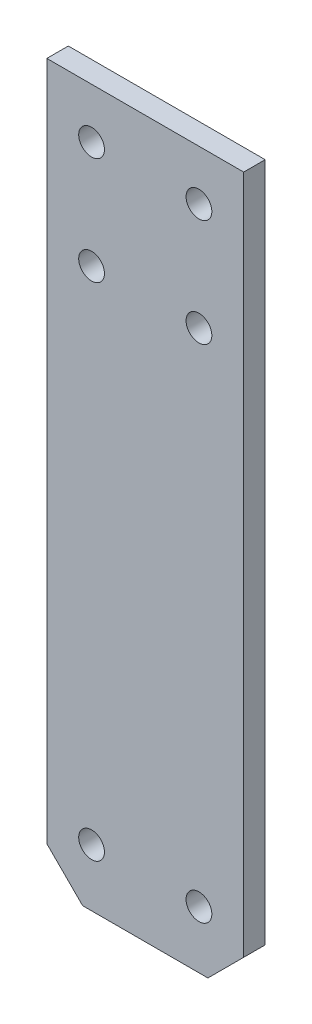
ISO-10303-21;
HEADER;
FILE_DESCRIPTION(('STEP AP214'),'2;1');
FILE_NAME('part.step','',(''),(''),'','','');
FILE_SCHEMA(('AUTOMOTIVE_DESIGN { 1 0 10303 214 1 1 1 1 }'));
ENDSEC;
DATA;
#1=APPLICATION_CONTEXT('core data for automotive mechanical design processes');
#2=APPLICATION_PROTOCOL_DEFINITION('international standard','automotive_design',2000,#1);
#3=PRODUCT_CONTEXT('',#1,'mechanical');
#4=PRODUCT('Part','Part','',(#3));
#5=PRODUCT_RELATED_PRODUCT_CATEGORY('part','',(#4));
#6=PRODUCT_DEFINITION_FORMATION('','',#4);
#7=PRODUCT_DEFINITION_CONTEXT('part definition',#1,'design');
#8=PRODUCT_DEFINITION('design','',#6,#7);
#9=PRODUCT_DEFINITION_SHAPE('','',#8);
#10=(LENGTH_UNIT() NAMED_UNIT(*) SI_UNIT(.MILLI.,.METRE.));
#11=(NAMED_UNIT(*) PLANE_ANGLE_UNIT() SI_UNIT($,.RADIAN.));
#12=(NAMED_UNIT(*) SI_UNIT($,.STERADIAN.) SOLID_ANGLE_UNIT());
#13=UNCERTAINTY_MEASURE_WITH_UNIT(LENGTH_MEASURE(1.E-05),#10,'distance_accuracy_value','');
#14=(GEOMETRIC_REPRESENTATION_CONTEXT(3) GLOBAL_UNCERTAINTY_ASSIGNED_CONTEXT((#13)) GLOBAL_UNIT_ASSIGNED_CONTEXT((#10,
#11,#12)) REPRESENTATION_CONTEXT('',''));
#15=CARTESIAN_POINT('',(0.,0.,0.));
#16=DIRECTION('',(0.,0.,1.));
#17=DIRECTION('',(1.,0.,0.));
#18=AXIS2_PLACEMENT_3D('',#15,#16,#17);
#19=CARTESIAN_POINT('',(13.75,-50.,3.));
#20=DIRECTION('',(-1.,0.,0.));
#21=DIRECTION('',(0.,0.,1.));
#22=AXIS2_PLACEMENT_3D('',#19,#20,#21);
#23=PLANE('',#22);
#24=DIRECTION('',(0.,1.,0.));
#25=VECTOR('',#24,1.);
#26=CARTESIAN_POINT('',(13.75,-50.,3.));
#27=LINE('',#26,#25);
#28=CARTESIAN_POINT('',(13.75,-45.,3.));
#29=VERTEX_POINT('',#28);
#30=CARTESIAN_POINT('',(13.75,50.,3.));
#31=VERTEX_POINT('',#30);
#32=EDGE_CURVE('E86',#29,#31,#27,.T.);
#33=ORIENTED_EDGE('',*,*,#32,.F.);
#34=DIRECTION('',(0.,0.,-1.));
#35=VECTOR('',#34,1.);
#36=CARTESIAN_POINT('',(13.75,-45.,3.));
#37=LINE('',#36,#35);
#38=CARTESIAN_POINT('',(13.75,-45.,0.));
#39=VERTEX_POINT('',#38);
#40=EDGE_CURVE('E109',#29,#39,#37,.T.);
#41=ORIENTED_EDGE('',*,*,#40,.T.);
#42=DIRECTION('',(0.,1.,0.));
#43=VECTOR('',#42,1.);
#44=CARTESIAN_POINT('',(13.75,-50.,0.));
#45=LINE('',#44,#43);
#46=CARTESIAN_POINT('',(13.75,50.,0.));
#47=VERTEX_POINT('',#46);
#48=EDGE_CURVE('E107',#39,#47,#45,.T.);
#49=ORIENTED_EDGE('',*,*,#48,.T.);
#50=DIRECTION('',(0.,0.,-1.));
#51=VECTOR('',#50,1.);
#52=CARTESIAN_POINT('',(13.75,50.,3.));
#53=LINE('',#52,#51);
#54=EDGE_CURVE('E101',#31,#47,#53,.T.);
#55=ORIENTED_EDGE('',*,*,#54,.F.);
#56=EDGE_LOOP('',(#33,#41,#49,#55));
#57=FACE_BOUND('',#56,.T.);
#58=ADVANCED_FACE('F32',(#57),#23,.F.);
#59=CARTESIAN_POINT('',(-13.75,50.,3.));
#60=DIRECTION('',(0.,-1.,0.));
#61=DIRECTION('',(0.,0.,-1.));
#62=AXIS2_PLACEMENT_3D('',#59,#60,#61);
#63=PLANE('',#62);
#64=DIRECTION('',(-1.,0.,0.));
#65=VECTOR('',#64,1.);
#66=CARTESIAN_POINT('',(-13.75,50.,0.));
#67=LINE('',#66,#65);
#68=CARTESIAN_POINT('',(-13.75,50.,0.));
#69=VERTEX_POINT('',#68);
#70=EDGE_CURVE('E160',#47,#69,#67,.T.);
#71=ORIENTED_EDGE('',*,*,#70,.T.);
#72=DIRECTION('',(0.,0.,-1.));
#73=VECTOR('',#72,1.);
#74=CARTESIAN_POINT('',(-13.75,50.,3.));
#75=LINE('',#74,#73);
#76=CARTESIAN_POINT('',(-13.75,50.,3.));
#77=VERTEX_POINT('',#76);
#78=EDGE_CURVE('E103',#77,#69,#75,.T.);
#79=ORIENTED_EDGE('',*,*,#78,.F.);
#80=DIRECTION('',(-1.,0.,0.));
#81=VECTOR('',#80,1.);
#82=CARTESIAN_POINT('',(-13.75,50.,3.));
#83=LINE('',#82,#81);
#84=EDGE_CURVE('E89',#31,#77,#83,.T.);
#85=ORIENTED_EDGE('',*,*,#84,.F.);
#86=ORIENTED_EDGE('',*,*,#54,.T.);
#87=EDGE_LOOP('',(#71,#79,#85,#86));
#88=FACE_BOUND('',#87,.T.);
#89=ADVANCED_FACE('F100',(#88),#63,.F.);
#90=CARTESIAN_POINT('',(-13.75,-50.,3.));
#91=DIRECTION('',(1.,0.,0.));
#92=DIRECTION('',(0.,0.,-1.));
#93=AXIS2_PLACEMENT_3D('',#90,#91,#92);
#94=PLANE('',#93);
#95=DIRECTION('',(0.,-1.,0.));
#96=VECTOR('',#95,1.);
#97=CARTESIAN_POINT('',(-13.75,-50.,0.));
#98=LINE('',#97,#96);
#99=CARTESIAN_POINT('',(-13.75,-45.,0.));
#100=VERTEX_POINT('',#99);
#101=EDGE_CURVE('E158',#69,#100,#98,.T.);
#102=ORIENTED_EDGE('',*,*,#101,.T.);
#103=DIRECTION('',(0.,0.,1.));
#104=VECTOR('',#103,1.);
#105=CARTESIAN_POINT('',(-13.75,-45.,3.));
#106=LINE('',#105,#104);
#107=CARTESIAN_POINT('',(-13.75,-45.,3.));
#108=VERTEX_POINT('',#107);
#109=EDGE_CURVE('E11',#100,#108,#106,.T.);
#110=ORIENTED_EDGE('',*,*,#109,.T.);
#111=DIRECTION('',(0.,-1.,0.));
#112=VECTOR('',#111,1.);
#113=CARTESIAN_POINT('',(-13.75,-50.,3.));
#114=LINE('',#113,#112);
#115=EDGE_CURVE('E104',#77,#108,#114,.T.);
#116=ORIENTED_EDGE('',*,*,#115,.F.);
#117=ORIENTED_EDGE('',*,*,#78,.T.);
#118=EDGE_LOOP('',(#102,#110,#116,#117));
#119=FACE_BOUND('',#118,.T.);
#120=ADVANCED_FACE('F159',(#119),#94,.F.);
#121=CARTESIAN_POINT('',(-13.75,-50.,3.));
#122=DIRECTION('',(0.,1.,0.));
#123=DIRECTION('',(0.,0.,1.));
#124=AXIS2_PLACEMENT_3D('',#121,#122,#123);
#125=PLANE('',#124);
#126=DIRECTION('',(1.,0.,0.));
#127=VECTOR('',#126,1.);
#128=CARTESIAN_POINT('',(-13.75,-50.,0.));
#129=LINE('',#128,#127);
#130=CARTESIAN_POINT('',(-8.75000000000002,-50.,0.));
#131=VERTEX_POINT('',#130);
#132=CARTESIAN_POINT('',(8.75000000000002,-50.,0.));
#133=VERTEX_POINT('',#132);
#134=EDGE_CURVE('E96',#131,#133,#129,.T.);
#135=ORIENTED_EDGE('',*,*,#134,.T.);
#136=DIRECTION('',(0.,0.,1.));
#137=VECTOR('',#136,1.);
#138=CARTESIAN_POINT('',(8.75000000000002,-50.,3.));
#139=LINE('',#138,#137);
#140=CARTESIAN_POINT('',(8.75000000000002,-50.,3.));
#141=VERTEX_POINT('',#140);
#142=EDGE_CURVE('E53',#133,#141,#139,.T.);
#143=ORIENTED_EDGE('',*,*,#142,.T.);
#144=DIRECTION('',(1.,0.,0.));
#145=VECTOR('',#144,1.);
#146=CARTESIAN_POINT('',(-13.75,-50.,3.));
#147=LINE('',#146,#145);
#148=CARTESIAN_POINT('',(-8.75000000000002,-50.,3.));
#149=VERTEX_POINT('',#148);
#150=EDGE_CURVE('E113',#149,#141,#147,.T.);
#151=ORIENTED_EDGE('',*,*,#150,.F.);
#152=DIRECTION('',(0.,0.,-1.));
#153=VECTOR('',#152,1.);
#154=CARTESIAN_POINT('',(-8.75000000000002,-50.,3.));
#155=LINE('',#154,#153);
#156=EDGE_CURVE('E144',#149,#131,#155,.T.);
#157=ORIENTED_EDGE('',*,*,#156,.T.);
#158=EDGE_LOOP('',(#135,#143,#151,#157));
#159=FACE_BOUND('',#158,.T.);
#160=ADVANCED_FACE('F152',(#159),#125,.F.);
#161=CARTESIAN_POINT('',(0.,0.,3.));
#162=DIRECTION('',(0.,0.,-1.));
#163=DIRECTION('',(-1.,0.,0.));
#164=AXIS2_PLACEMENT_3D('',#161,#162,#163);
#165=PLANE('',#164);
#166=CARTESIAN_POINT('',(-7.5,43.,3.));
#167=DIRECTION('',(0.,0.,1.));
#168=DIRECTION('',(1.,0.,0.));
#169=AXIS2_PLACEMENT_3D('',#166,#167,#168);
#170=CIRCLE('',#169,1.8);
#171=CARTESIAN_POINT('',(-5.7,43.,3.));
#172=VERTEX_POINT('',#171);
#173=EDGE_CURVE('E139',#172,#172,#170,.T.);
#174=ORIENTED_EDGE('',*,*,#173,.F.);
#175=EDGE_LOOP('',(#174));
#176=FACE_BOUND('',#175,.T.);
#177=CARTESIAN_POINT('',(7.5,43.,3.));
#178=DIRECTION('',(0.,0.,1.));
#179=DIRECTION('',(1.,0.,0.));
#180=AXIS2_PLACEMENT_3D('',#177,#178,#179);
#181=CIRCLE('',#180,1.8);
#182=CARTESIAN_POINT('',(9.3,43.,3.));
#183=VERTEX_POINT('',#182);
#184=EDGE_CURVE('E136',#183,#183,#181,.T.);
#185=ORIENTED_EDGE('',*,*,#184,.F.);
#186=EDGE_LOOP('',(#185));
#187=FACE_BOUND('',#186,.T.);
#188=CARTESIAN_POINT('',(7.5,28.,3.));
#189=DIRECTION('',(0.,0.,1.));
#190=DIRECTION('',(1.,0.,0.));
#191=AXIS2_PLACEMENT_3D('',#188,#189,#190);
#192=CIRCLE('',#191,1.8);
#193=CARTESIAN_POINT('',(9.3,28.,3.));
#194=VERTEX_POINT('',#193);
#195=EDGE_CURVE('E132',#194,#194,#192,.T.);
#196=ORIENTED_EDGE('',*,*,#195,.F.);
#197=EDGE_LOOP('',(#196));
#198=FACE_BOUND('',#197,.T.);
#199=CARTESIAN_POINT('',(-7.5,28.,3.));
#200=DIRECTION('',(0.,0.,1.));
#201=DIRECTION('',(1.,0.,0.));
#202=AXIS2_PLACEMENT_3D('',#199,#200,#201);
#203=CIRCLE('',#202,1.8);
#204=CARTESIAN_POINT('',(-5.7,28.,3.));
#205=VERTEX_POINT('',#204);
#206=EDGE_CURVE('E128',#205,#205,#203,.T.);
#207=ORIENTED_EDGE('',*,*,#206,.F.);
#208=EDGE_LOOP('',(#207));
#209=FACE_BOUND('',#208,.T.);
#210=CARTESIAN_POINT('',(-7.5,-42.,3.));
#211=DIRECTION('',(0.,0.,1.));
#212=DIRECTION('',(1.,0.,0.));
#213=AXIS2_PLACEMENT_3D('',#210,#211,#212);
#214=CIRCLE('',#213,1.8);
#215=CARTESIAN_POINT('',(-5.7,-42.,3.));
#216=VERTEX_POINT('',#215);
#217=EDGE_CURVE('E124',#216,#216,#214,.T.);
#218=ORIENTED_EDGE('',*,*,#217,.F.);
#219=EDGE_LOOP('',(#218));
#220=FACE_BOUND('',#219,.T.);
#221=CARTESIAN_POINT('',(7.5,-42.,3.));
#222=DIRECTION('',(0.,0.,1.));
#223=DIRECTION('',(1.,0.,0.));
#224=AXIS2_PLACEMENT_3D('',#221,#222,#223);
#225=CIRCLE('',#224,1.8);
#226=CARTESIAN_POINT('',(9.3,-42.,3.));
#227=VERTEX_POINT('',#226);
#228=EDGE_CURVE('E120',#227,#227,#225,.T.);
#229=ORIENTED_EDGE('',*,*,#228,.F.);
#230=EDGE_LOOP('',(#229));
#231=FACE_BOUND('',#230,.T.);
#232=ORIENTED_EDGE('',*,*,#150,.T.);
#233=DIRECTION('',(-0.707106781186546,-0.707106781186549,0.));
#234=VECTOR('',#233,1.);
#235=CARTESIAN_POINT('',(13.75,-45.,3.));
#236=LINE('',#235,#234);
#237=EDGE_CURVE('E40',#141,#29,#236,.F.);
#238=ORIENTED_EDGE('',*,*,#237,.T.);
#239=ORIENTED_EDGE('',*,*,#32,.T.);
#240=ORIENTED_EDGE('',*,*,#84,.T.);
#241=ORIENTED_EDGE('',*,*,#115,.T.);
#242=DIRECTION('',(-0.707106781186546,0.707106781186549,0.));
#243=VECTOR('',#242,1.);
#244=CARTESIAN_POINT('',(-8.75000000000002,-50.,3.));
#245=LINE('',#244,#243);
#246=EDGE_CURVE('E148',#108,#149,#245,.F.);
#247=ORIENTED_EDGE('',*,*,#246,.T.);
#248=EDGE_LOOP('',(#232,#238,#239,#240,#241,#247));
#249=FACE_BOUND('',#248,.T.);
#250=ADVANCED_FACE('F88',(#176,#187,#198,#209,#220,#231,#249),#165,.F.);
#251=CARTESIAN_POINT('',(0.,0.,0.));
#252=DIRECTION('',(0.,0.,-1.));
#253=DIRECTION('',(-1.,0.,0.));
#254=AXIS2_PLACEMENT_3D('',#251,#252,#253);
#255=PLANE('',#254);
#256=CARTESIAN_POINT('',(-7.5,43.,0.));
#257=DIRECTION('',(0.,0.,-1.));
#258=DIRECTION('',(-1.,0.,0.));
#259=AXIS2_PLACEMENT_3D('',#256,#257,#258);
#260=CIRCLE('',#259,1.79999999999999);
#261=CARTESIAN_POINT('',(-9.3,43.,0.));
#262=VERTEX_POINT('',#261);
#263=EDGE_CURVE('E137',#262,#262,#260,.T.);
#264=ORIENTED_EDGE('',*,*,#263,.F.);
#265=EDGE_LOOP('',(#264));
#266=FACE_BOUND('',#265,.T.);
#267=CARTESIAN_POINT('',(7.5,43.,0.));
#268=DIRECTION('',(0.,0.,-1.));
#269=DIRECTION('',(-1.,0.,0.));
#270=AXIS2_PLACEMENT_3D('',#267,#268,#269);
#271=CIRCLE('',#270,1.8);
#272=CARTESIAN_POINT('',(5.70000000000001,43.,0.));
#273=VERTEX_POINT('',#272);
#274=EDGE_CURVE('E133',#273,#273,#271,.T.);
#275=ORIENTED_EDGE('',*,*,#274,.F.);
#276=EDGE_LOOP('',(#275));
#277=FACE_BOUND('',#276,.T.);
#278=CARTESIAN_POINT('',(7.5,28.,0.));
#279=DIRECTION('',(0.,0.,-1.));
#280=DIRECTION('',(-1.,0.,0.));
#281=AXIS2_PLACEMENT_3D('',#278,#279,#280);
#282=CIRCLE('',#281,1.8);
#283=CARTESIAN_POINT('',(5.70000000000001,28.,0.));
#284=VERTEX_POINT('',#283);
#285=EDGE_CURVE('E129',#284,#284,#282,.T.);
#286=ORIENTED_EDGE('',*,*,#285,.F.);
#287=EDGE_LOOP('',(#286));
#288=FACE_BOUND('',#287,.T.);
#289=CARTESIAN_POINT('',(-7.5,28.,0.));
#290=DIRECTION('',(0.,0.,-1.));
#291=DIRECTION('',(-1.,0.,0.));
#292=AXIS2_PLACEMENT_3D('',#289,#290,#291);
#293=CIRCLE('',#292,1.79999999999999);
#294=CARTESIAN_POINT('',(-9.3,28.,0.));
#295=VERTEX_POINT('',#294);
#296=EDGE_CURVE('E125',#295,#295,#293,.T.);
#297=ORIENTED_EDGE('',*,*,#296,.F.);
#298=EDGE_LOOP('',(#297));
#299=FACE_BOUND('',#298,.T.);
#300=CARTESIAN_POINT('',(-7.5,-42.,0.));
#301=DIRECTION('',(0.,0.,-1.));
#302=DIRECTION('',(-1.,0.,0.));
#303=AXIS2_PLACEMENT_3D('',#300,#301,#302);
#304=CIRCLE('',#303,1.79999999999999);
#305=CARTESIAN_POINT('',(-9.3,-42.,0.));
#306=VERTEX_POINT('',#305);
#307=EDGE_CURVE('E121',#306,#306,#304,.T.);
#308=ORIENTED_EDGE('',*,*,#307,.F.);
#309=EDGE_LOOP('',(#308));
#310=FACE_BOUND('',#309,.T.);
#311=CARTESIAN_POINT('',(7.5,-42.,0.));
#312=DIRECTION('',(0.,0.,-1.));
#313=DIRECTION('',(-1.,0.,0.));
#314=AXIS2_PLACEMENT_3D('',#311,#312,#313);
#315=CIRCLE('',#314,1.8);
#316=CARTESIAN_POINT('',(5.70000000000001,-42.,0.));
#317=VERTEX_POINT('',#316);
#318=EDGE_CURVE('E117',#317,#317,#315,.T.);
#319=ORIENTED_EDGE('',*,*,#318,.F.);
#320=EDGE_LOOP('',(#319));
#321=FACE_BOUND('',#320,.T.);
#322=ORIENTED_EDGE('',*,*,#48,.F.);
#323=DIRECTION('',(0.707106781186546,0.707106781186549,0.));
#324=VECTOR('',#323,1.);
#325=CARTESIAN_POINT('',(29.375,-29.3749999999999,0.));
#326=LINE('',#325,#324);
#327=EDGE_CURVE('E142',#39,#133,#326,.F.);
#328=ORIENTED_EDGE('',*,*,#327,.T.);
#329=ORIENTED_EDGE('',*,*,#134,.F.);
#330=DIRECTION('',(0.707106781186546,-0.707106781186549,0.));
#331=VECTOR('',#330,1.);
#332=CARTESIAN_POINT('',(-29.375,-29.3749999999999,0.));
#333=LINE('',#332,#331);
#334=EDGE_CURVE('E111',#131,#100,#333,.F.);
#335=ORIENTED_EDGE('',*,*,#334,.T.);
#336=ORIENTED_EDGE('',*,*,#101,.F.);
#337=ORIENTED_EDGE('',*,*,#70,.F.);
#338=EDGE_LOOP('',(#322,#328,#329,#335,#336,#337));
#339=FACE_BOUND('',#338,.T.);
#340=ADVANCED_FACE('F157',(#266,#277,#288,#299,#310,#321,#339),#255,.T.);
#341=CARTESIAN_POINT('',(7.5,-42.,3.));
#342=DIRECTION('',(0.,0.,1.));
#343=DIRECTION('',(1.,0.,0.));
#344=AXIS2_PLACEMENT_3D('',#341,#342,#343);
#345=CYLINDRICAL_SURFACE('',#344,1.8);
#346=ORIENTED_EDGE('',*,*,#318,.T.);
#347=EDGE_LOOP('',(#346));
#348=FACE_BOUND('',#347,.T.);
#349=ORIENTED_EDGE('',*,*,#228,.T.);
#350=EDGE_LOOP('',(#349));
#351=FACE_BOUND('',#350,.T.);
#352=ADVANCED_FACE('F194',(#348,#351),#345,.F.);
#353=CARTESIAN_POINT('',(-7.5,-42.,3.));
#354=DIRECTION('',(0.,0.,1.));
#355=DIRECTION('',(1.,0.,0.));
#356=AXIS2_PLACEMENT_3D('',#353,#354,#355);
#357=CYLINDRICAL_SURFACE('',#356,1.79999999999999);
#358=ORIENTED_EDGE('',*,*,#307,.T.);
#359=EDGE_LOOP('',(#358));
#360=FACE_BOUND('',#359,.T.);
#361=ORIENTED_EDGE('',*,*,#217,.T.);
#362=EDGE_LOOP('',(#361));
#363=FACE_BOUND('',#362,.T.);
#364=ADVANCED_FACE('F196',(#360,#363),#357,.F.);
#365=CARTESIAN_POINT('',(-7.5,28.,3.));
#366=DIRECTION('',(0.,0.,1.));
#367=DIRECTION('',(1.,0.,0.));
#368=AXIS2_PLACEMENT_3D('',#365,#366,#367);
#369=CYLINDRICAL_SURFACE('',#368,1.79999999999999);
#370=ORIENTED_EDGE('',*,*,#296,.T.);
#371=EDGE_LOOP('',(#370));
#372=FACE_BOUND('',#371,.T.);
#373=ORIENTED_EDGE('',*,*,#206,.T.);
#374=EDGE_LOOP('',(#373));
#375=FACE_BOUND('',#374,.T.);
#376=ADVANCED_FACE('F203',(#372,#375),#369,.F.);
#377=CARTESIAN_POINT('',(7.5,28.,3.));
#378=DIRECTION('',(0.,0.,1.));
#379=DIRECTION('',(1.,0.,0.));
#380=AXIS2_PLACEMENT_3D('',#377,#378,#379);
#381=CYLINDRICAL_SURFACE('',#380,1.8);
#382=ORIENTED_EDGE('',*,*,#285,.T.);
#383=EDGE_LOOP('',(#382));
#384=FACE_BOUND('',#383,.T.);
#385=ORIENTED_EDGE('',*,*,#195,.T.);
#386=EDGE_LOOP('',(#385));
#387=FACE_BOUND('',#386,.T.);
#388=ADVANCED_FACE('F228',(#384,#387),#381,.F.);
#389=CARTESIAN_POINT('',(7.5,43.,3.));
#390=DIRECTION('',(0.,0.,1.));
#391=DIRECTION('',(1.,0.,0.));
#392=AXIS2_PLACEMENT_3D('',#389,#390,#391);
#393=CYLINDRICAL_SURFACE('',#392,1.8);
#394=ORIENTED_EDGE('',*,*,#274,.T.);
#395=EDGE_LOOP('',(#394));
#396=FACE_BOUND('',#395,.T.);
#397=ORIENTED_EDGE('',*,*,#184,.T.);
#398=EDGE_LOOP('',(#397));
#399=FACE_BOUND('',#398,.T.);
#400=ADVANCED_FACE('F222',(#396,#399),#393,.F.);
#401=CARTESIAN_POINT('',(-7.5,43.,3.));
#402=DIRECTION('',(0.,0.,1.));
#403=DIRECTION('',(1.,0.,0.));
#404=AXIS2_PLACEMENT_3D('',#401,#402,#403);
#405=CYLINDRICAL_SURFACE('',#404,1.79999999999999);
#406=ORIENTED_EDGE('',*,*,#263,.T.);
#407=EDGE_LOOP('',(#406));
#408=FACE_BOUND('',#407,.T.);
#409=ORIENTED_EDGE('',*,*,#173,.T.);
#410=EDGE_LOOP('',(#409));
#411=FACE_BOUND('',#410,.T.);
#412=ADVANCED_FACE('F179',(#408,#411),#405,.F.);
#413=CARTESIAN_POINT('',(13.75,-45.,3.));
#414=DIRECTION('',(-0.707106781186549,0.707106781186546,0.));
#415=DIRECTION('',(0.,0.,-1.));
#416=AXIS2_PLACEMENT_3D('',#413,#414,#415);
#417=PLANE('',#416);
#418=ORIENTED_EDGE('',*,*,#237,.F.);
#419=ORIENTED_EDGE('',*,*,#142,.F.);
#420=ORIENTED_EDGE('',*,*,#327,.F.);
#421=ORIENTED_EDGE('',*,*,#40,.F.);
#422=EDGE_LOOP('',(#418,#419,#420,#421));
#423=FACE_BOUND('',#422,.T.);
#424=ADVANCED_FACE('F215',(#423),#417,.F.);
#425=CARTESIAN_POINT('',(-8.75000000000002,-50.,3.));
#426=DIRECTION('',(0.707106781186549,0.707106781186546,0.));
#427=DIRECTION('',(0.,0.,-1.));
#428=AXIS2_PLACEMENT_3D('',#425,#426,#427);
#429=PLANE('',#428);
#430=ORIENTED_EDGE('',*,*,#246,.F.);
#431=ORIENTED_EDGE('',*,*,#109,.F.);
#432=ORIENTED_EDGE('',*,*,#334,.F.);
#433=ORIENTED_EDGE('',*,*,#156,.F.);
#434=EDGE_LOOP('',(#430,#431,#432,#433));
#435=FACE_BOUND('',#434,.T.);
#436=ADVANCED_FACE('F34',(#435),#429,.F.);
#437=CLOSED_SHELL('',(#58,#89,#120,#160,#250,#340,#352,#364,#376,#388,#400,#412,#424,#436));
#438=MANIFOLD_SOLID_BREP('B2',#437);
#439=ADVANCED_BREP_SHAPE_REPRESENTATION('',(#18,#438),#14);
#440=SHAPE_DEFINITION_REPRESENTATION(#9,#439);
ENDSEC;
END-ISO-10303-21;
